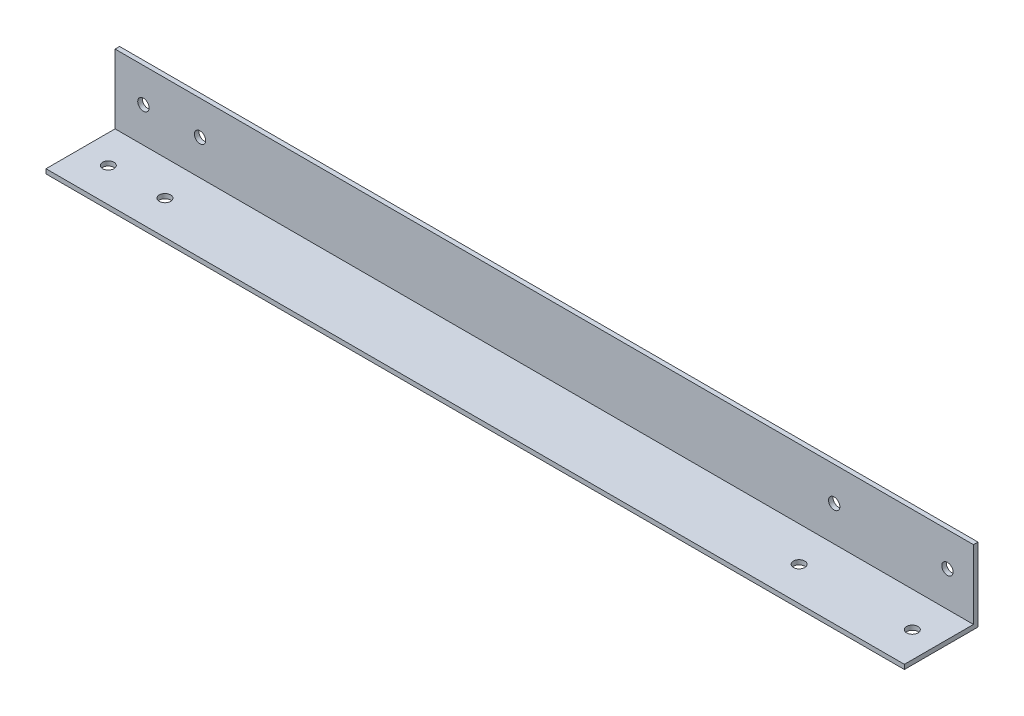
ISO-10303-21;
HEADER;
FILE_DESCRIPTION(('STEP AP214'),'2;1');
FILE_NAME('part.step','',(''),(''),'','','');
FILE_SCHEMA(('AUTOMOTIVE_DESIGN { 1 0 10303 214 1 1 1 1 }'));
ENDSEC;
DATA;
#1=APPLICATION_CONTEXT('core data for automotive mechanical design processes');
#2=APPLICATION_PROTOCOL_DEFINITION('international standard','automotive_design',2000,#1);
#3=PRODUCT_CONTEXT('',#1,'mechanical');
#4=PRODUCT('Part','Part','',(#3));
#5=PRODUCT_RELATED_PRODUCT_CATEGORY('part','',(#4));
#6=PRODUCT_DEFINITION_FORMATION('','',#4);
#7=PRODUCT_DEFINITION_CONTEXT('part definition',#1,'design');
#8=PRODUCT_DEFINITION('design','',#6,#7);
#9=PRODUCT_DEFINITION_SHAPE('','',#8);
#10=(LENGTH_UNIT() NAMED_UNIT(*) SI_UNIT(.MILLI.,.METRE.));
#11=(NAMED_UNIT(*) PLANE_ANGLE_UNIT() SI_UNIT($,.RADIAN.));
#12=(NAMED_UNIT(*) SI_UNIT($,.STERADIAN.) SOLID_ANGLE_UNIT());
#13=UNCERTAINTY_MEASURE_WITH_UNIT(LENGTH_MEASURE(1.E-05),#10,'distance_accuracy_value','');
#14=(GEOMETRIC_REPRESENTATION_CONTEXT(3) GLOBAL_UNCERTAINTY_ASSIGNED_CONTEXT((#13)) GLOBAL_UNIT_ASSIGNED_CONTEXT((#10,
#11,#12)) REPRESENTATION_CONTEXT('',''));
#15=CARTESIAN_POINT('',(0.,0.,0.));
#16=DIRECTION('',(0.,0.,1.));
#17=DIRECTION('',(1.,0.,0.));
#18=AXIS2_PLACEMENT_3D('',#15,#16,#17);
#19=CARTESIAN_POINT('',(758.,0.,0.));
#20=DIRECTION('',(0.,1.,0.));
#21=DIRECTION('',(0.,0.,-1.));
#22=AXIS2_PLACEMENT_3D('',#19,#20,#21);
#23=PLANE('',#22);
#24=CARTESIAN_POINT('',(75.,0.,35.));
#25=DIRECTION('',(0.,1.,0.));
#26=DIRECTION('',(0.,0.,1.));
#27=AXIS2_PLACEMENT_3D('',#24,#25,#26);
#28=CIRCLE('',#27,4.99999999999999);
#29=CARTESIAN_POINT('',(75.,0.,40.));
#30=VERTEX_POINT('',#29);
#31=EDGE_CURVE('E147',#30,#30,#28,.T.);
#32=ORIENTED_EDGE('',*,*,#31,.T.);
#33=EDGE_LOOP('',(#32));
#34=FACE_BOUND('',#33,.T.);
#35=CARTESIAN_POINT('',(735.,0.,35.));
#36=DIRECTION('',(0.,1.,0.));
#37=DIRECTION('',(0.,0.,-1.));
#38=AXIS2_PLACEMENT_3D('',#35,#36,#37);
#39=CIRCLE('',#38,5.00000000000005);
#40=CARTESIAN_POINT('',(735.,0.,30.));
#41=VERTEX_POINT('',#40);
#42=EDGE_CURVE('E215',#41,#41,#39,.T.);
#43=ORIENTED_EDGE('',*,*,#42,.T.);
#44=EDGE_LOOP('',(#43));
#45=FACE_BOUND('',#44,.T.);
#46=CARTESIAN_POINT('',(635.,0.,35.));
#47=DIRECTION('',(0.,1.,0.));
#48=DIRECTION('',(0.,0.,-1.));
#49=AXIS2_PLACEMENT_3D('',#46,#47,#48);
#50=CIRCLE('',#49,5.00000000000005);
#51=CARTESIAN_POINT('',(635.,0.,30.));
#52=VERTEX_POINT('',#51);
#53=EDGE_CURVE('E160',#52,#52,#50,.T.);
#54=ORIENTED_EDGE('',*,*,#53,.T.);
#55=EDGE_LOOP('',(#54));
#56=FACE_BOUND('',#55,.T.);
#57=CARTESIAN_POINT('',(25.,0.,35.));
#58=DIRECTION('',(0.,1.,0.));
#59=DIRECTION('',(0.,0.,1.));
#60=AXIS2_PLACEMENT_3D('',#57,#58,#59);
#61=CIRCLE('',#60,5.);
#62=CARTESIAN_POINT('',(25.,0.,40.));
#63=VERTEX_POINT('',#62);
#64=EDGE_CURVE('E143',#63,#63,#61,.T.);
#65=ORIENTED_EDGE('',*,*,#64,.T.);
#66=EDGE_LOOP('',(#65));
#67=FACE_BOUND('',#66,.T.);
#68=DIRECTION('',(0.,0.,1.));
#69=VECTOR('',#68,1.);
#70=CARTESIAN_POINT('',(0.,0.,0.));
#71=LINE('',#70,#69);
#72=CARTESIAN_POINT('',(0.,0.,0.));
#73=VERTEX_POINT('',#72);
#74=CARTESIAN_POINT('',(0.,0.,65.));
#75=VERTEX_POINT('',#74);
#76=EDGE_CURVE('E122',#73,#75,#71,.T.);
#77=ORIENTED_EDGE('',*,*,#76,.F.);
#78=DIRECTION('',(-1.,0.,0.));
#79=VECTOR('',#78,1.);
#80=CARTESIAN_POINT('',(758.,0.,0.));
#81=LINE('',#80,#79);
#82=CARTESIAN_POINT('',(758.,0.,0.));
#83=VERTEX_POINT('',#82);
#84=EDGE_CURVE('E121',#83,#73,#81,.T.);
#85=ORIENTED_EDGE('',*,*,#84,.F.);
#86=DIRECTION('',(0.,0.,1.));
#87=VECTOR('',#86,1.);
#88=CARTESIAN_POINT('',(758.,0.,0.));
#89=LINE('',#88,#87);
#90=CARTESIAN_POINT('',(758.,0.,65.));
#91=VERTEX_POINT('',#90);
#92=EDGE_CURVE('E133',#83,#91,#89,.T.);
#93=ORIENTED_EDGE('',*,*,#92,.T.);
#94=DIRECTION('',(-1.,0.,0.));
#95=VECTOR('',#94,1.);
#96=CARTESIAN_POINT('',(758.,0.,65.));
#97=LINE('',#96,#95);
#98=EDGE_CURVE('E11',#91,#75,#97,.T.);
#99=ORIENTED_EDGE('',*,*,#98,.T.);
#100=EDGE_LOOP('',(#77,#85,#93,#99));
#101=FACE_BOUND('',#100,.T.);
#102=ADVANCED_FACE('F37',(#34,#45,#56,#67,#101),#23,.F.);
#103=CARTESIAN_POINT('',(758.,4.,65.));
#104=DIRECTION('',(0.,0.,1.));
#105=DIRECTION('',(-1.,0.,0.));
#106=AXIS2_PLACEMENT_3D('',#103,#104,#105);
#107=PLANE('',#106);
#108=DIRECTION('',(0.,-1.,0.));
#109=VECTOR('',#108,1.);
#110=CARTESIAN_POINT('',(0.,4.,65.));
#111=LINE('',#110,#109);
#112=CARTESIAN_POINT('',(0.,4.,65.));
#113=VERTEX_POINT('',#112);
#114=EDGE_CURVE('E124',#113,#75,#111,.T.);
#115=ORIENTED_EDGE('',*,*,#114,.T.);
#116=ORIENTED_EDGE('',*,*,#98,.F.);
#117=DIRECTION('',(0.,-1.,0.));
#118=VECTOR('',#117,1.);
#119=CARTESIAN_POINT('',(758.,4.,65.));
#120=LINE('',#119,#118);
#121=CARTESIAN_POINT('',(758.,4.,65.));
#122=VERTEX_POINT('',#121);
#123=EDGE_CURVE('E87',#122,#91,#120,.T.);
#124=ORIENTED_EDGE('',*,*,#123,.F.);
#125=DIRECTION('',(-1.,0.,0.));
#126=VECTOR('',#125,1.);
#127=CARTESIAN_POINT('',(758.,4.,65.));
#128=LINE('',#127,#126);
#129=EDGE_CURVE('E46',#122,#113,#128,.T.);
#130=ORIENTED_EDGE('',*,*,#129,.T.);
#131=EDGE_LOOP('',(#115,#116,#124,#130));
#132=FACE_BOUND('',#131,.T.);
#133=ADVANCED_FACE('F202',(#132),#107,.T.);
#134=CARTESIAN_POINT('',(758.,4.,0.));
#135=DIRECTION('',(0.,1.,0.));
#136=DIRECTION('',(0.,0.,-1.));
#137=AXIS2_PLACEMENT_3D('',#134,#135,#136);
#138=PLANE('',#137);
#139=CARTESIAN_POINT('',(75.,4.,35.));
#140=DIRECTION('',(0.,-1.,0.));
#141=DIRECTION('',(0.,0.,-1.));
#142=AXIS2_PLACEMENT_3D('',#139,#140,#141);
#143=CIRCLE('',#142,4.99999999999999);
#144=CARTESIAN_POINT('',(75.,4.,30.));
#145=VERTEX_POINT('',#144);
#146=EDGE_CURVE('E40',#145,#145,#143,.T.);
#147=ORIENTED_EDGE('',*,*,#146,.T.);
#148=EDGE_LOOP('',(#147));
#149=FACE_BOUND('',#148,.T.);
#150=CARTESIAN_POINT('',(735.,4.,35.));
#151=DIRECTION('',(0.,-1.,0.));
#152=DIRECTION('',(0.,0.,-1.));
#153=AXIS2_PLACEMENT_3D('',#150,#151,#152);
#154=CIRCLE('',#153,5.00000000000005);
#155=CARTESIAN_POINT('',(735.,4.,30.));
#156=VERTEX_POINT('',#155);
#157=EDGE_CURVE('E146',#156,#156,#154,.T.);
#158=ORIENTED_EDGE('',*,*,#157,.T.);
#159=EDGE_LOOP('',(#158));
#160=FACE_BOUND('',#159,.T.);
#161=CARTESIAN_POINT('',(635.,4.,35.));
#162=DIRECTION('',(0.,-1.,0.));
#163=DIRECTION('',(0.,0.,-1.));
#164=AXIS2_PLACEMENT_3D('',#161,#162,#163);
#165=CIRCLE('',#164,5.00000000000005);
#166=CARTESIAN_POINT('',(635.,4.,30.));
#167=VERTEX_POINT('',#166);
#168=EDGE_CURVE('E144',#167,#167,#165,.T.);
#169=ORIENTED_EDGE('',*,*,#168,.T.);
#170=EDGE_LOOP('',(#169));
#171=FACE_BOUND('',#170,.T.);
#172=CARTESIAN_POINT('',(25.,4.,35.));
#173=DIRECTION('',(0.,-1.,0.));
#174=DIRECTION('',(0.,0.,-1.));
#175=AXIS2_PLACEMENT_3D('',#172,#173,#174);
#176=CIRCLE('',#175,5.);
#177=CARTESIAN_POINT('',(25.,4.,30.));
#178=VERTEX_POINT('',#177);
#179=EDGE_CURVE('E139',#178,#178,#176,.T.);
#180=ORIENTED_EDGE('',*,*,#179,.T.);
#181=EDGE_LOOP('',(#180));
#182=FACE_BOUND('',#181,.T.);
#183=DIRECTION('',(0.,0.,1.));
#184=VECTOR('',#183,1.);
#185=CARTESIAN_POINT('',(0.,4.,0.));
#186=LINE('',#185,#184);
#187=CARTESIAN_POINT('',(0.,4.,4.));
#188=VERTEX_POINT('',#187);
#189=EDGE_CURVE('E127',#188,#113,#186,.T.);
#190=ORIENTED_EDGE('',*,*,#189,.T.);
#191=ORIENTED_EDGE('',*,*,#129,.F.);
#192=DIRECTION('',(0.,0.,1.));
#193=VECTOR('',#192,1.);
#194=CARTESIAN_POINT('',(758.,4.,0.));
#195=LINE('',#194,#193);
#196=CARTESIAN_POINT('',(758.,4.,4.));
#197=VERTEX_POINT('',#196);
#198=EDGE_CURVE('E115',#197,#122,#195,.T.);
#199=ORIENTED_EDGE('',*,*,#198,.F.);
#200=DIRECTION('',(-1.,0.,0.));
#201=VECTOR('',#200,1.);
#202=CARTESIAN_POINT('',(758.,4.,4.));
#203=LINE('',#202,#201);
#204=EDGE_CURVE('E109',#197,#188,#203,.T.);
#205=ORIENTED_EDGE('',*,*,#204,.T.);
#206=EDGE_LOOP('',(#190,#191,#199,#205));
#207=FACE_BOUND('',#206,.T.);
#208=ADVANCED_FACE('F207',(#149,#160,#171,#182,#207),#138,.T.);
#209=CARTESIAN_POINT('',(758.,0.,4.));
#210=DIRECTION('',(0.,0.,1.));
#211=DIRECTION('',(-1.,0.,0.));
#212=AXIS2_PLACEMENT_3D('',#209,#210,#211);
#213=PLANE('',#212);
#214=CARTESIAN_POINT('',(75.,35.,4.));
#215=DIRECTION('',(0.,0.,-1.));
#216=DIRECTION('',(-1.,0.,0.));
#217=AXIS2_PLACEMENT_3D('',#214,#215,#216);
#218=CIRCLE('',#217,5.00000000000001);
#219=CARTESIAN_POINT('',(70.,35.,4.));
#220=VERTEX_POINT('',#219);
#221=EDGE_CURVE('E176',#220,#220,#218,.T.);
#222=ORIENTED_EDGE('',*,*,#221,.T.);
#223=EDGE_LOOP('',(#222));
#224=FACE_BOUND('',#223,.T.);
#225=CARTESIAN_POINT('',(735.,35.,4.));
#226=DIRECTION('',(0.,0.,-1.));
#227=DIRECTION('',(-1.,0.,0.));
#228=AXIS2_PLACEMENT_3D('',#225,#226,#227);
#229=CIRCLE('',#228,5.00000000000005);
#230=CARTESIAN_POINT('',(730.,35.,4.));
#231=VERTEX_POINT('',#230);
#232=EDGE_CURVE('E173',#231,#231,#229,.T.);
#233=ORIENTED_EDGE('',*,*,#232,.T.);
#234=EDGE_LOOP('',(#233));
#235=FACE_BOUND('',#234,.T.);
#236=CARTESIAN_POINT('',(635.,35.,4.));
#237=DIRECTION('',(0.,0.,-1.));
#238=DIRECTION('',(-1.,0.,0.));
#239=AXIS2_PLACEMENT_3D('',#236,#237,#238);
#240=CIRCLE('',#239,5.00000000000005);
#241=CARTESIAN_POINT('',(630.,35.,4.));
#242=VERTEX_POINT('',#241);
#243=EDGE_CURVE('E165',#242,#242,#240,.T.);
#244=ORIENTED_EDGE('',*,*,#243,.T.);
#245=EDGE_LOOP('',(#244));
#246=FACE_BOUND('',#245,.T.);
#247=CARTESIAN_POINT('',(25.,35.,4.));
#248=DIRECTION('',(0.,0.,-1.));
#249=DIRECTION('',(-1.,0.,0.));
#250=AXIS2_PLACEMENT_3D('',#247,#248,#249);
#251=CIRCLE('',#250,5.);
#252=CARTESIAN_POINT('',(20.,35.,4.));
#253=VERTEX_POINT('',#252);
#254=EDGE_CURVE('E125',#253,#253,#251,.T.);
#255=ORIENTED_EDGE('',*,*,#254,.T.);
#256=EDGE_LOOP('',(#255));
#257=FACE_BOUND('',#256,.T.);
#258=DIRECTION('',(0.,1.,0.));
#259=VECTOR('',#258,1.);
#260=CARTESIAN_POINT('',(0.,0.,4.));
#261=LINE('',#260,#259);
#262=CARTESIAN_POINT('',(0.,65.,4.));
#263=VERTEX_POINT('',#262);
#264=EDGE_CURVE('E129',#263,#188,#261,.F.);
#265=ORIENTED_EDGE('',*,*,#264,.T.);
#266=ORIENTED_EDGE('',*,*,#204,.F.);
#267=DIRECTION('',(0.,1.,0.));
#268=VECTOR('',#267,1.);
#269=CARTESIAN_POINT('',(758.,0.,4.));
#270=LINE('',#269,#268);
#271=CARTESIAN_POINT('',(758.,65.,4.));
#272=VERTEX_POINT('',#271);
#273=EDGE_CURVE('E99',#272,#197,#270,.F.);
#274=ORIENTED_EDGE('',*,*,#273,.F.);
#275=DIRECTION('',(-1.,0.,0.));
#276=VECTOR('',#275,1.);
#277=CARTESIAN_POINT('',(758.,65.,4.));
#278=LINE('',#277,#276);
#279=EDGE_CURVE('E104',#272,#263,#278,.T.);
#280=ORIENTED_EDGE('',*,*,#279,.T.);
#281=EDGE_LOOP('',(#265,#266,#274,#280));
#282=FACE_BOUND('',#281,.T.);
#283=ADVANCED_FACE('F112',(#224,#235,#246,#257,#282),#213,.T.);
#284=CARTESIAN_POINT('',(758.,65.,0.));
#285=DIRECTION('',(0.,1.,0.));
#286=DIRECTION('',(0.,0.,-1.));
#287=AXIS2_PLACEMENT_3D('',#284,#285,#286);
#288=PLANE('',#287);
#289=DIRECTION('',(0.,0.,1.));
#290=VECTOR('',#289,1.);
#291=CARTESIAN_POINT('',(0.,65.,0.));
#292=LINE('',#291,#290);
#293=CARTESIAN_POINT('',(0.,65.,0.));
#294=VERTEX_POINT('',#293);
#295=EDGE_CURVE('E106',#294,#263,#292,.T.);
#296=ORIENTED_EDGE('',*,*,#295,.T.);
#297=ORIENTED_EDGE('',*,*,#279,.F.);
#298=DIRECTION('',(0.,0.,1.));
#299=VECTOR('',#298,1.);
#300=CARTESIAN_POINT('',(758.,65.,0.));
#301=LINE('',#300,#299);
#302=CARTESIAN_POINT('',(758.,65.,0.));
#303=VERTEX_POINT('',#302);
#304=EDGE_CURVE('E95',#303,#272,#301,.T.);
#305=ORIENTED_EDGE('',*,*,#304,.F.);
#306=DIRECTION('',(-1.,0.,0.));
#307=VECTOR('',#306,1.);
#308=CARTESIAN_POINT('',(758.,65.,0.));
#309=LINE('',#308,#307);
#310=EDGE_CURVE('E110',#303,#294,#309,.T.);
#311=ORIENTED_EDGE('',*,*,#310,.T.);
#312=EDGE_LOOP('',(#296,#297,#305,#311));
#313=FACE_BOUND('',#312,.T.);
#314=ADVANCED_FACE('F105',(#313),#288,.T.);
#315=CARTESIAN_POINT('',(758.,0.,0.));
#316=DIRECTION('',(0.,0.,1.));
#317=DIRECTION('',(-1.,0.,0.));
#318=AXIS2_PLACEMENT_3D('',#315,#316,#317);
#319=PLANE('',#318);
#320=CARTESIAN_POINT('',(75.,35.,0.));
#321=DIRECTION('',(0.,0.,1.));
#322=DIRECTION('',(1.,0.,0.));
#323=AXIS2_PLACEMENT_3D('',#320,#321,#322);
#324=CIRCLE('',#323,5.00000000000001);
#325=CARTESIAN_POINT('',(80.,35.,0.));
#326=VERTEX_POINT('',#325);
#327=EDGE_CURVE('E162',#326,#326,#324,.T.);
#328=ORIENTED_EDGE('',*,*,#327,.T.);
#329=EDGE_LOOP('',(#328));
#330=FACE_BOUND('',#329,.T.);
#331=CARTESIAN_POINT('',(735.,35.,0.));
#332=DIRECTION('',(0.,0.,1.));
#333=DIRECTION('',(-1.,0.,0.));
#334=AXIS2_PLACEMENT_3D('',#331,#332,#333);
#335=CIRCLE('',#334,5.00000000000005);
#336=CARTESIAN_POINT('',(730.,35.,0.));
#337=VERTEX_POINT('',#336);
#338=EDGE_CURVE('E166',#337,#337,#335,.T.);
#339=ORIENTED_EDGE('',*,*,#338,.T.);
#340=EDGE_LOOP('',(#339));
#341=FACE_BOUND('',#340,.T.);
#342=CARTESIAN_POINT('',(635.,35.,0.));
#343=DIRECTION('',(0.,0.,1.));
#344=DIRECTION('',(-1.,0.,0.));
#345=AXIS2_PLACEMENT_3D('',#342,#343,#344);
#346=CIRCLE('',#345,5.00000000000005);
#347=CARTESIAN_POINT('',(630.,35.,0.));
#348=VERTEX_POINT('',#347);
#349=EDGE_CURVE('E142',#348,#348,#346,.T.);
#350=ORIENTED_EDGE('',*,*,#349,.T.);
#351=EDGE_LOOP('',(#350));
#352=FACE_BOUND('',#351,.T.);
#353=CARTESIAN_POINT('',(25.,35.,0.));
#354=DIRECTION('',(0.,0.,1.));
#355=DIRECTION('',(1.,0.,0.));
#356=AXIS2_PLACEMENT_3D('',#353,#354,#355);
#357=CIRCLE('',#356,5.);
#358=CARTESIAN_POINT('',(30.,35.,0.));
#359=VERTEX_POINT('',#358);
#360=EDGE_CURVE('E179',#359,#359,#357,.T.);
#361=ORIENTED_EDGE('',*,*,#360,.T.);
#362=EDGE_LOOP('',(#361));
#363=FACE_BOUND('',#362,.T.);
#364=DIRECTION('',(0.,-1.,0.));
#365=VECTOR('',#364,1.);
#366=CARTESIAN_POINT('',(0.,0.,0.));
#367=LINE('',#366,#365);
#368=EDGE_CURVE('E75',#294,#73,#367,.T.);
#369=ORIENTED_EDGE('',*,*,#368,.F.);
#370=ORIENTED_EDGE('',*,*,#310,.F.);
#371=DIRECTION('',(0.,-1.,0.));
#372=VECTOR('',#371,1.);
#373=CARTESIAN_POINT('',(758.,0.,0.));
#374=LINE('',#373,#372);
#375=EDGE_CURVE('E55',#303,#83,#374,.T.);
#376=ORIENTED_EDGE('',*,*,#375,.T.);
#377=ORIENTED_EDGE('',*,*,#84,.T.);
#378=EDGE_LOOP('',(#369,#370,#376,#377));
#379=FACE_BOUND('',#378,.T.);
#380=ADVANCED_FACE('F188',(#330,#341,#352,#363,#379),#319,.F.);
#381=CARTESIAN_POINT('',(758.,0.,0.));
#382=DIRECTION('',(-1.,0.,0.));
#383=DIRECTION('',(0.,0.,-1.));
#384=AXIS2_PLACEMENT_3D('',#381,#382,#383);
#385=PLANE('',#384);
#386=ORIENTED_EDGE('',*,*,#92,.F.);
#387=ORIENTED_EDGE('',*,*,#375,.F.);
#388=ORIENTED_EDGE('',*,*,#304,.T.);
#389=ORIENTED_EDGE('',*,*,#273,.T.);
#390=ORIENTED_EDGE('',*,*,#198,.T.);
#391=ORIENTED_EDGE('',*,*,#123,.T.);
#392=EDGE_LOOP('',(#386,#387,#388,#389,#390,#391));
#393=FACE_BOUND('',#392,.T.);
#394=ADVANCED_FACE('F97',(#393),#385,.F.);
#395=CARTESIAN_POINT('',(0.,0.,0.));
#396=DIRECTION('',(-1.,0.,0.));
#397=DIRECTION('',(0.,0.,-1.));
#398=AXIS2_PLACEMENT_3D('',#395,#396,#397);
#399=PLANE('',#398);
#400=ORIENTED_EDGE('',*,*,#76,.T.);
#401=ORIENTED_EDGE('',*,*,#114,.F.);
#402=ORIENTED_EDGE('',*,*,#189,.F.);
#403=ORIENTED_EDGE('',*,*,#264,.F.);
#404=ORIENTED_EDGE('',*,*,#295,.F.);
#405=ORIENTED_EDGE('',*,*,#368,.T.);
#406=EDGE_LOOP('',(#400,#401,#402,#403,#404,#405));
#407=FACE_BOUND('',#406,.T.);
#408=ADVANCED_FACE('F196',(#407),#399,.T.);
#409=CARTESIAN_POINT('',(25.,35.,10.));
#410=DIRECTION('',(0.,0.,-1.));
#411=DIRECTION('',(1.,0.,0.));
#412=AXIS2_PLACEMENT_3D('',#409,#410,#411);
#413=CYLINDRICAL_SURFACE('',#412,5.);
#414=ORIENTED_EDGE('',*,*,#254,.F.);
#415=EDGE_LOOP('',(#414));
#416=FACE_BOUND('',#415,.T.);
#417=ORIENTED_EDGE('',*,*,#360,.F.);
#418=EDGE_LOOP('',(#417));
#419=FACE_BOUND('',#418,.T.);
#420=ADVANCED_FACE('F249',(#416,#419),#413,.F.);
#421=CARTESIAN_POINT('',(635.,35.,10.));
#422=DIRECTION('',(0.,0.,-1.));
#423=DIRECTION('',(1.,0.,0.));
#424=AXIS2_PLACEMENT_3D('',#421,#422,#423);
#425=CYLINDRICAL_SURFACE('',#424,5.00000000000005);
#426=ORIENTED_EDGE('',*,*,#243,.F.);
#427=EDGE_LOOP('',(#426));
#428=FACE_BOUND('',#427,.T.);
#429=ORIENTED_EDGE('',*,*,#349,.F.);
#430=EDGE_LOOP('',(#429));
#431=FACE_BOUND('',#430,.T.);
#432=ADVANCED_FACE('F245',(#428,#431),#425,.F.);
#433=CARTESIAN_POINT('',(735.,35.,10.));
#434=DIRECTION('',(0.,0.,-1.));
#435=DIRECTION('',(1.,0.,0.));
#436=AXIS2_PLACEMENT_3D('',#433,#434,#435);
#437=CYLINDRICAL_SURFACE('',#436,5.00000000000005);
#438=ORIENTED_EDGE('',*,*,#232,.F.);
#439=EDGE_LOOP('',(#438));
#440=FACE_BOUND('',#439,.T.);
#441=ORIENTED_EDGE('',*,*,#338,.F.);
#442=EDGE_LOOP('',(#441));
#443=FACE_BOUND('',#442,.T.);
#444=ADVANCED_FACE('F241',(#440,#443),#437,.F.);
#445=CARTESIAN_POINT('',(75.,35.,10.));
#446=DIRECTION('',(0.,0.,-1.));
#447=DIRECTION('',(1.,0.,0.));
#448=AXIS2_PLACEMENT_3D('',#445,#446,#447);
#449=CYLINDRICAL_SURFACE('',#448,5.00000000000001);
#450=ORIENTED_EDGE('',*,*,#221,.F.);
#451=EDGE_LOOP('',(#450));
#452=FACE_BOUND('',#451,.T.);
#453=ORIENTED_EDGE('',*,*,#327,.F.);
#454=EDGE_LOOP('',(#453));
#455=FACE_BOUND('',#454,.T.);
#456=ADVANCED_FACE('F233',(#452,#455),#449,.F.);
#457=CARTESIAN_POINT('',(25.,10.,35.));
#458=DIRECTION('',(0.,-1.,0.));
#459=DIRECTION('',(0.,0.,1.));
#460=AXIS2_PLACEMENT_3D('',#457,#458,#459);
#461=CYLINDRICAL_SURFACE('',#460,5.);
#462=ORIENTED_EDGE('',*,*,#179,.F.);
#463=EDGE_LOOP('',(#462));
#464=FACE_BOUND('',#463,.T.);
#465=ORIENTED_EDGE('',*,*,#64,.F.);
#466=EDGE_LOOP('',(#465));
#467=FACE_BOUND('',#466,.T.);
#468=ADVANCED_FACE('F223',(#464,#467),#461,.F.);
#469=CARTESIAN_POINT('',(635.,10.,35.));
#470=DIRECTION('',(0.,-1.,0.));
#471=DIRECTION('',(0.,0.,1.));
#472=AXIS2_PLACEMENT_3D('',#469,#470,#471);
#473=CYLINDRICAL_SURFACE('',#472,5.00000000000005);
#474=ORIENTED_EDGE('',*,*,#168,.F.);
#475=EDGE_LOOP('',(#474));
#476=FACE_BOUND('',#475,.T.);
#477=ORIENTED_EDGE('',*,*,#53,.F.);
#478=EDGE_LOOP('',(#477));
#479=FACE_BOUND('',#478,.T.);
#480=ADVANCED_FACE('F220',(#476,#479),#473,.F.);
#481=CARTESIAN_POINT('',(735.,10.,35.));
#482=DIRECTION('',(0.,-1.,0.));
#483=DIRECTION('',(0.,0.,1.));
#484=AXIS2_PLACEMENT_3D('',#481,#482,#483);
#485=CYLINDRICAL_SURFACE('',#484,5.00000000000005);
#486=ORIENTED_EDGE('',*,*,#157,.F.);
#487=EDGE_LOOP('',(#486));
#488=FACE_BOUND('',#487,.T.);
#489=ORIENTED_EDGE('',*,*,#42,.F.);
#490=EDGE_LOOP('',(#489));
#491=FACE_BOUND('',#490,.T.);
#492=ADVANCED_FACE('F222',(#488,#491),#485,.F.);
#493=CARTESIAN_POINT('',(75.,10.,35.));
#494=DIRECTION('',(0.,-1.,0.));
#495=DIRECTION('',(0.,0.,1.));
#496=AXIS2_PLACEMENT_3D('',#493,#494,#495);
#497=CYLINDRICAL_SURFACE('',#496,4.99999999999999);
#498=ORIENTED_EDGE('',*,*,#146,.F.);
#499=EDGE_LOOP('',(#498));
#500=FACE_BOUND('',#499,.T.);
#501=ORIENTED_EDGE('',*,*,#31,.F.);
#502=EDGE_LOOP('',(#501));
#503=FACE_BOUND('',#502,.T.);
#504=ADVANCED_FACE('F230',(#500,#503),#497,.F.);
#505=CLOSED_SHELL('',(#102,#133,#208,#283,#314,#380,#394,#408,#420,#432,#444,#456,#468,#480,
#492,#504));
#506=MANIFOLD_SOLID_BREP('B2',#505);
#507=ADVANCED_BREP_SHAPE_REPRESENTATION('',(#18,#506),#14);
#508=SHAPE_DEFINITION_REPRESENTATION(#9,#507);
ENDSEC;
END-ISO-10303-21;
